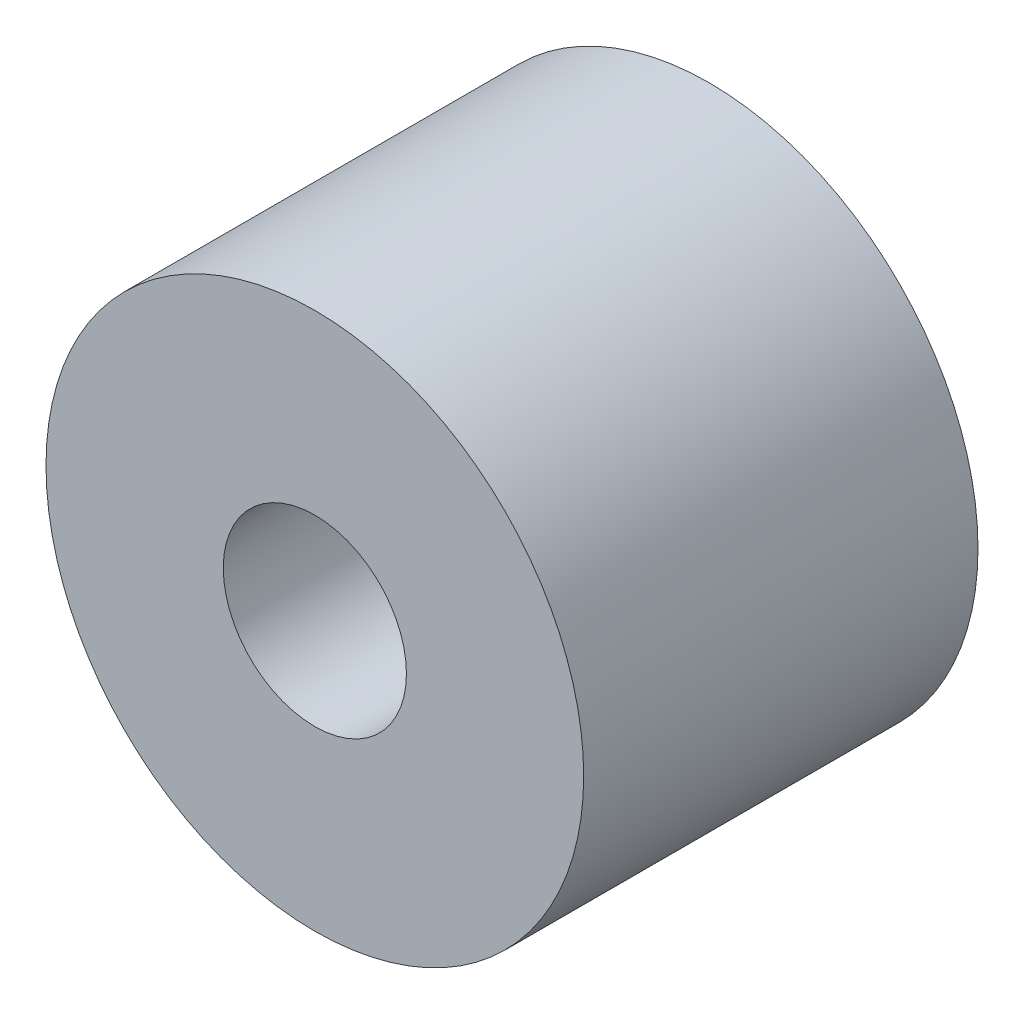
ISO-10303-21;
HEADER;
FILE_DESCRIPTION(('STEP AP214'),'2;1');
FILE_NAME('part.step','',(''),(''),'','','');
FILE_SCHEMA(('AUTOMOTIVE_DESIGN { 1 0 10303 214 1 1 1 1 }'));
ENDSEC;
DATA;
#1=APPLICATION_CONTEXT('core data for automotive mechanical design processes');
#2=APPLICATION_PROTOCOL_DEFINITION('international standard','automotive_design',2000,#1);
#3=PRODUCT_CONTEXT('',#1,'mechanical');
#4=PRODUCT('Part','Part','',(#3));
#5=PRODUCT_RELATED_PRODUCT_CATEGORY('part','',(#4));
#6=PRODUCT_DEFINITION_FORMATION('','',#4);
#7=PRODUCT_DEFINITION_CONTEXT('part definition',#1,'design');
#8=PRODUCT_DEFINITION('design','',#6,#7);
#9=PRODUCT_DEFINITION_SHAPE('','',#8);
#10=(LENGTH_UNIT() NAMED_UNIT(*) SI_UNIT(.MILLI.,.METRE.));
#11=(NAMED_UNIT(*) PLANE_ANGLE_UNIT() SI_UNIT($,.RADIAN.));
#12=(NAMED_UNIT(*) SI_UNIT($,.STERADIAN.) SOLID_ANGLE_UNIT());
#13=UNCERTAINTY_MEASURE_WITH_UNIT(LENGTH_MEASURE(1.E-05),#10,'distance_accuracy_value','');
#14=(GEOMETRIC_REPRESENTATION_CONTEXT(3) GLOBAL_UNCERTAINTY_ASSIGNED_CONTEXT((#13)) GLOBAL_UNIT_ASSIGNED_CONTEXT((#10,
#11,#12)) REPRESENTATION_CONTEXT('',''));
#15=CARTESIAN_POINT('',(0.,0.,0.));
#16=DIRECTION('',(0.,0.,1.));
#17=DIRECTION('',(1.,0.,0.));
#18=AXIS2_PLACEMENT_3D('',#15,#16,#17);
#19=CARTESIAN_POINT('',(0.,0.,11.));
#20=DIRECTION('',(0.,0.,1.));
#21=DIRECTION('',(1.,0.,0.));
#22=AXIS2_PLACEMENT_3D('',#19,#20,#21);
#23=PLANE('',#22);
#24=CARTESIAN_POINT('',(0.,0.,11.));
#25=DIRECTION('',(0.,0.,1.));
#26=DIRECTION('',(1.,0.,0.));
#27=AXIS2_PLACEMENT_3D('',#24,#25,#26);
#28=CIRCLE('',#27,7.5);
#29=CARTESIAN_POINT('',(7.5,0.,11.));
#30=VERTEX_POINT('',#29);
#31=EDGE_CURVE('E10',#30,#30,#28,.T.);
#32=ORIENTED_EDGE('',*,*,#31,.T.);
#33=EDGE_LOOP('',(#32));
#34=FACE_BOUND('',#33,.T.);
#35=CARTESIAN_POINT('',(0.,0.,11.));
#36=DIRECTION('',(0.,0.,1.));
#37=DIRECTION('',(1.,0.,0.));
#38=AXIS2_PLACEMENT_3D('',#35,#36,#37);
#39=CIRCLE('',#38,2.555);
#40=CARTESIAN_POINT('',(2.555,0.,11.));
#41=VERTEX_POINT('',#40);
#42=EDGE_CURVE('E47',#41,#41,#39,.T.);
#43=ORIENTED_EDGE('',*,*,#42,.F.);
#44=EDGE_LOOP('',(#43));
#45=FACE_BOUND('',#44,.T.);
#46=ADVANCED_FACE('F36',(#34,#45),#23,.T.);
#47=CARTESIAN_POINT('',(0.,0.,0.));
#48=DIRECTION('',(0.,0.,1.));
#49=DIRECTION('',(1.,0.,0.));
#50=AXIS2_PLACEMENT_3D('',#47,#48,#49);
#51=PLANE('',#50);
#52=CARTESIAN_POINT('',(0.,0.,0.));
#53=DIRECTION('',(0.,0.,1.));
#54=DIRECTION('',(1.,0.,0.));
#55=AXIS2_PLACEMENT_3D('',#52,#53,#54);
#56=CIRCLE('',#55,7.5);
#57=CARTESIAN_POINT('',(7.5,0.,0.));
#58=VERTEX_POINT('',#57);
#59=EDGE_CURVE('E40',#58,#58,#56,.T.);
#60=ORIENTED_EDGE('',*,*,#59,.F.);
#61=EDGE_LOOP('',(#60));
#62=FACE_BOUND('',#61,.T.);
#63=CARTESIAN_POINT('',(0.,0.,0.));
#64=DIRECTION('',(0.,0.,1.));
#65=DIRECTION('',(1.,0.,0.));
#66=AXIS2_PLACEMENT_3D('',#63,#64,#65);
#67=CIRCLE('',#66,2.555);
#68=CARTESIAN_POINT('',(2.555,0.,0.));
#69=VERTEX_POINT('',#68);
#70=EDGE_CURVE('E49',#69,#69,#67,.T.);
#71=ORIENTED_EDGE('',*,*,#70,.T.);
#72=EDGE_LOOP('',(#71));
#73=FACE_BOUND('',#72,.T.);
#74=ADVANCED_FACE('F59',(#62,#73),#51,.F.);
#75=CARTESIAN_POINT('',(0.,0.,11.));
#76=DIRECTION('',(0.,0.,-1.));
#77=DIRECTION('',(-1.,0.,0.));
#78=AXIS2_PLACEMENT_3D('',#75,#76,#77);
#79=CYLINDRICAL_SURFACE('',#78,7.5);
#80=ORIENTED_EDGE('',*,*,#31,.F.);
#81=EDGE_LOOP('',(#80));
#82=FACE_BOUND('',#81,.T.);
#83=ORIENTED_EDGE('',*,*,#59,.T.);
#84=EDGE_LOOP('',(#83));
#85=FACE_BOUND('',#84,.T.);
#86=ADVANCED_FACE('F38',(#82,#85),#79,.T.);
#87=CARTESIAN_POINT('',(0.,0.,11.));
#88=DIRECTION('',(0.,0.,-1.));
#89=DIRECTION('',(-1.,0.,0.));
#90=AXIS2_PLACEMENT_3D('',#87,#88,#89);
#91=CYLINDRICAL_SURFACE('',#90,2.555);
#92=ORIENTED_EDGE('',*,*,#42,.T.);
#93=EDGE_LOOP('',(#92));
#94=FACE_BOUND('',#93,.T.);
#95=ORIENTED_EDGE('',*,*,#70,.F.);
#96=EDGE_LOOP('',(#95));
#97=FACE_BOUND('',#96,.T.);
#98=ADVANCED_FACE('F55',(#94,#97),#91,.F.);
#99=CLOSED_SHELL('',(#46,#74,#86,#98));
#100=MANIFOLD_SOLID_BREP('B2',#99);
#101=ADVANCED_BREP_SHAPE_REPRESENTATION('',(#18,#100),#14);
#102=SHAPE_DEFINITION_REPRESENTATION(#9,#101);
ENDSEC;
END-ISO-10303-21;
